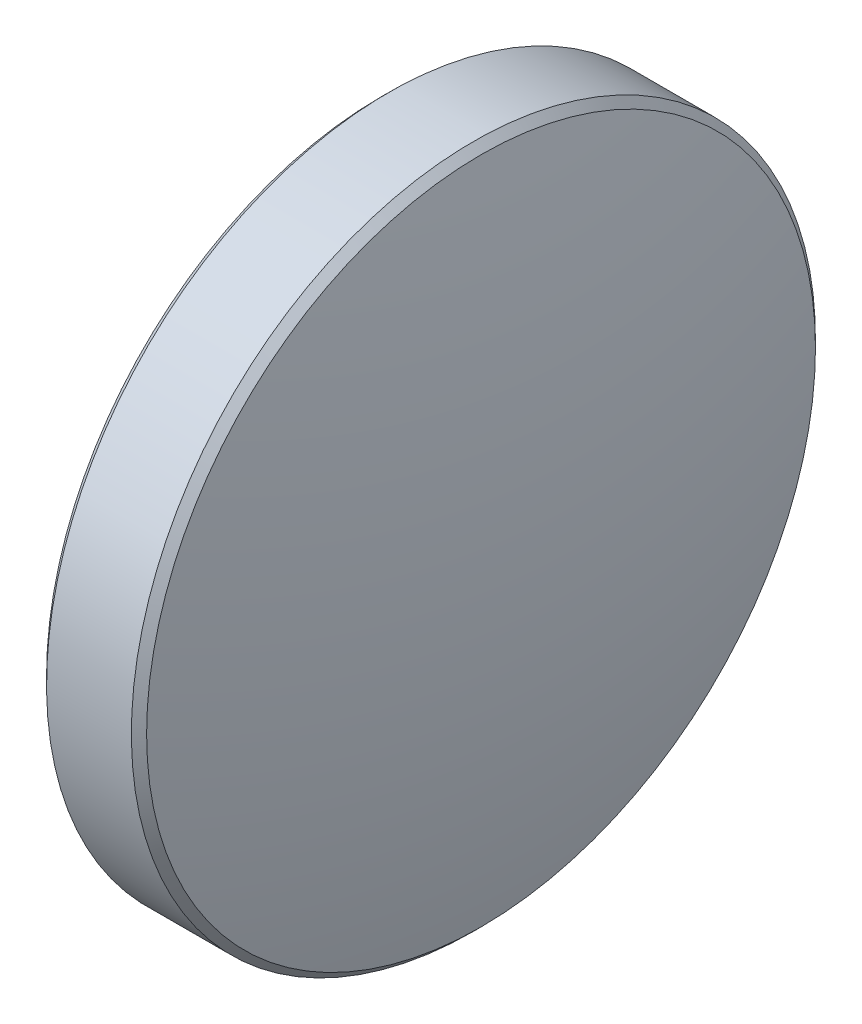
ISO-10303-21;
HEADER;
FILE_DESCRIPTION(('STEP AP214'),'2;1');
FILE_NAME('part.step','',(''),(''),'','','');
FILE_SCHEMA(('AUTOMOTIVE_DESIGN { 1 0 10303 214 1 1 1 1 }'));
ENDSEC;
DATA;
#1=APPLICATION_CONTEXT('core data for automotive mechanical design processes');
#2=APPLICATION_PROTOCOL_DEFINITION('international standard','automotive_design',2000,#1);
#3=PRODUCT_CONTEXT('',#1,'mechanical');
#4=PRODUCT('Part','Part','',(#3));
#5=PRODUCT_RELATED_PRODUCT_CATEGORY('part','',(#4));
#6=PRODUCT_DEFINITION_FORMATION('','',#4);
#7=PRODUCT_DEFINITION_CONTEXT('part definition',#1,'design');
#8=PRODUCT_DEFINITION('design','',#6,#7);
#9=PRODUCT_DEFINITION_SHAPE('','',#8);
#10=(LENGTH_UNIT() NAMED_UNIT(*) SI_UNIT(.MILLI.,.METRE.));
#11=(NAMED_UNIT(*) PLANE_ANGLE_UNIT() SI_UNIT($,.RADIAN.));
#12=(NAMED_UNIT(*) SI_UNIT($,.STERADIAN.) SOLID_ANGLE_UNIT());
#13=UNCERTAINTY_MEASURE_WITH_UNIT(LENGTH_MEASURE(1.E-05),#10,'distance_accuracy_value','');
#14=(GEOMETRIC_REPRESENTATION_CONTEXT(3) GLOBAL_UNCERTAINTY_ASSIGNED_CONTEXT((#13)) GLOBAL_UNIT_ASSIGNED_CONTEXT((#10,
#11,#12)) REPRESENTATION_CONTEXT('',''));
#15=CARTESIAN_POINT('',(0.,0.,0.));
#16=DIRECTION('',(0.,0.,1.));
#17=DIRECTION('',(1.,0.,0.));
#18=AXIS2_PLACEMENT_3D('',#15,#16,#17);
#19=CARTESIAN_POINT('',(25.4499999655142,0.00136716192724758,0.));
#20=DIRECTION('',(0.,0.,-1.));
#21=DIRECTION('',(0.,-1.,0.));
#22=AXIS2_PLACEMENT_3D('',#19,#20,#21);
#23=CIRCLE('',#22,27.1);
#24=TRIMMED_CURVE('',#23,(PARAMETER_VALUE(-1.57074587801527)),
(PARAMETER_VALUE(1.57074587801527)),.T.,.PARAMETER.);
#25=CARTESIAN_POINT('',(25.4499999655142,0.,0.));
#26=DIRECTION('',(-1.,0.,0.));
#27=AXIS1_PLACEMENT('',#25,#26);
#28=SURFACE_OF_REVOLUTION('',#24,#27);
#29=CARTESIAN_POINT('',(-1.65,0.,0.));
#30=VERTEX_POINT('',#29);
#31=VERTEX_LOOP('',#30);
#32=FACE_BOUND('',#31,.T.);
#33=CARTESIAN_POINT('',(-0.928903974763443,0.,0.));
#34=DIRECTION('',(-1.,0.,0.));
#35=DIRECTION('',(0.,-1.,0.));
#36=AXIS2_PLACEMENT_3D('',#33,#34,#35);
#37=CIRCLE('',#36,6.20857864376269);
#38=CARTESIAN_POINT('',(-0.928903974763442,-6.20857864376269,0.));
#39=VERTEX_POINT('',#38);
#40=EDGE_CURVE('E9',#39,#39,#37,.T.);
#41=ORIENTED_EDGE('',*,*,#40,.T.);
#42=EDGE_LOOP('',(#41));
#43=FACE_BOUND('',#42,.T.);
#44=ADVANCED_FACE('F14',(#32,#43),#28,.T.);
#45=CARTESIAN_POINT('',(-0.787482618526135,0.,0.));
#46=DIRECTION('',(1.,0.,0.));
#47=DIRECTION('',(0.,1.,0.));
#48=AXIS2_PLACEMENT_3D('',#45,#46,#47);
#49=CONICAL_SURFACE('',#48,6.35,0.785398163397457);
#50=ORIENTED_EDGE('',*,*,#40,.F.);
#51=EDGE_LOOP('',(#50));
#52=FACE_BOUND('',#51,.T.);
#53=CARTESIAN_POINT('',(-0.787482618526135,0.,0.));
#54=DIRECTION('',(-1.,0.,0.));
#55=DIRECTION('',(0.,-1.,0.));
#56=AXIS2_PLACEMENT_3D('',#53,#54,#55);
#57=CIRCLE('',#56,6.35);
#58=CARTESIAN_POINT('',(-0.787482618526133,-6.35,0.));
#59=VERTEX_POINT('',#58);
#60=EDGE_CURVE('E21',#59,#59,#57,.T.);
#61=ORIENTED_EDGE('',*,*,#60,.T.);
#62=EDGE_LOOP('',(#61));
#63=FACE_BOUND('',#62,.T.);
#64=ADVANCED_FACE('F29',(#52,#63),#49,.T.);
#65=CARTESIAN_POINT('',(-1.65,0.,0.));
#66=DIRECTION('',(-1.,0.,0.));
#67=DIRECTION('',(0.,-1.,0.));
#68=AXIS2_PLACEMENT_3D('',#65,#66,#67);
#69=CYLINDRICAL_SURFACE('',#68,6.35);
#70=ORIENTED_EDGE('',*,*,#60,.F.);
#71=EDGE_LOOP('',(#70));
#72=FACE_BOUND('',#71,.T.);
#73=CARTESIAN_POINT('',(0.787482618526137,0.,0.));
#74=DIRECTION('',(-1.,0.,0.));
#75=DIRECTION('',(0.,-1.,0.));
#76=AXIS2_PLACEMENT_3D('',#73,#74,#75);
#77=CIRCLE('',#76,6.35);
#78=CARTESIAN_POINT('',(0.787482618526139,-6.35,0.));
#79=VERTEX_POINT('',#78);
#80=EDGE_CURVE('E38',#79,#79,#77,.T.);
#81=ORIENTED_EDGE('',*,*,#80,.T.);
#82=EDGE_LOOP('',(#81));
#83=FACE_BOUND('',#82,.T.);
#84=ADVANCED_FACE('F34',(#72,#83),#69,.T.);
#85=CARTESIAN_POINT('',(0.928903974763443,0.,0.));
#86=DIRECTION('',(-1.,0.,0.));
#87=DIRECTION('',(0.,-1.,0.));
#88=AXIS2_PLACEMENT_3D('',#85,#86,#87);
#89=CONICAL_SURFACE('',#88,6.2085786437627,0.785398163397441);
#90=ORIENTED_EDGE('',*,*,#80,.F.);
#91=EDGE_LOOP('',(#90));
#92=FACE_BOUND('',#91,.T.);
#93=CARTESIAN_POINT('',(0.928903974763443,0.,0.));
#94=DIRECTION('',(-1.,0.,0.));
#95=DIRECTION('',(0.,-1.,0.));
#96=AXIS2_PLACEMENT_3D('',#93,#94,#95);
#97=CIRCLE('',#96,6.2085786437627);
#98=CARTESIAN_POINT('',(0.928903974763444,-6.20857864376269,0.));
#99=VERTEX_POINT('',#98);
#100=EDGE_CURVE('E40',#99,#99,#97,.T.);
#101=ORIENTED_EDGE('',*,*,#100,.T.);
#102=EDGE_LOOP('',(#101));
#103=FACE_BOUND('',#102,.T.);
#104=ADVANCED_FACE('F46',(#92,#103),#89,.T.);
#105=CARTESIAN_POINT('',(-25.4499999655142,0.00136716192721631,0.));
#106=DIRECTION('',(0.,0.,-1.));
#107=DIRECTION('',(0.,-1.,0.));
#108=AXIS2_PLACEMENT_3D('',#105,#106,#107);
#109=CIRCLE('',#108,27.1);
#110=TRIMMED_CURVE('',#109,(PARAMETER_VALUE(-1.57074587801527)),
(PARAMETER_VALUE(1.57074587801527)),.T.,.PARAMETER.);
#111=CARTESIAN_POINT('',(-25.4499999655142,0.,0.));
#112=DIRECTION('',(-1.,0.,0.));
#113=AXIS1_PLACEMENT('',#111,#112);
#114=SURFACE_OF_REVOLUTION('',#110,#113);
#115=ORIENTED_EDGE('',*,*,#100,.F.);
#116=EDGE_LOOP('',(#115));
#117=FACE_BOUND('',#116,.T.);
#118=CARTESIAN_POINT('',(1.65,0.,0.));
#119=VERTEX_POINT('',#118);
#120=VERTEX_LOOP('',#119);
#121=FACE_BOUND('',#120,.T.);
#122=ADVANCED_FACE('F48',(#117,#121),#114,.T.);
#123=CLOSED_SHELL('',(#44,#64,#84,#104,#122));
#124=MANIFOLD_SOLID_BREP('B1',#123);
#125=ADVANCED_BREP_SHAPE_REPRESENTATION('',(#18,#124),#14);
#126=SHAPE_DEFINITION_REPRESENTATION(#9,#125);
ENDSEC;
END-ISO-10303-21;
